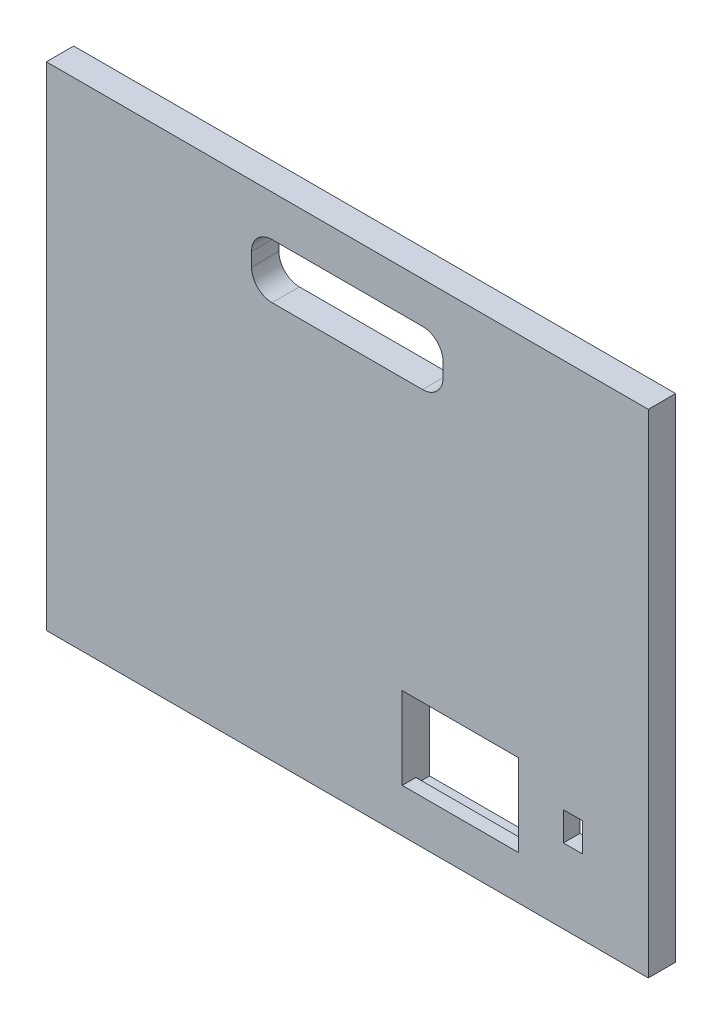
ISO-10303-21;
HEADER;
FILE_DESCRIPTION(('STEP AP214'),'2;1');
FILE_NAME('part.step','',(''),(''),'','','');
FILE_SCHEMA(('AUTOMOTIVE_DESIGN { 1 0 10303 214 1 1 1 1 }'));
ENDSEC;
DATA;
#1=APPLICATION_CONTEXT('core data for automotive mechanical design processes');
#2=APPLICATION_PROTOCOL_DEFINITION('international standard','automotive_design',2000,#1);
#3=PRODUCT_CONTEXT('',#1,'mechanical');
#4=PRODUCT('Part','Part','',(#3));
#5=PRODUCT_RELATED_PRODUCT_CATEGORY('part','',(#4));
#6=PRODUCT_DEFINITION_FORMATION('','',#4);
#7=PRODUCT_DEFINITION_CONTEXT('part definition',#1,'design');
#8=PRODUCT_DEFINITION('design','',#6,#7);
#9=PRODUCT_DEFINITION_SHAPE('','',#8);
#10=(LENGTH_UNIT() NAMED_UNIT(*) SI_UNIT(.MILLI.,.METRE.));
#11=(NAMED_UNIT(*) PLANE_ANGLE_UNIT() SI_UNIT($,.RADIAN.));
#12=(NAMED_UNIT(*) SI_UNIT($,.STERADIAN.) SOLID_ANGLE_UNIT());
#13=UNCERTAINTY_MEASURE_WITH_UNIT(LENGTH_MEASURE(1.E-05),#10,'distance_accuracy_value','');
#14=(GEOMETRIC_REPRESENTATION_CONTEXT(3) GLOBAL_UNCERTAINTY_ASSIGNED_CONTEXT((#13)) GLOBAL_UNIT_ASSIGNED_CONTEXT((#10,
#11,#12)) REPRESENTATION_CONTEXT('',''));
#15=CARTESIAN_POINT('',(0.,0.,0.));
#16=DIRECTION('',(0.,0.,1.));
#17=DIRECTION('',(1.,0.,0.));
#18=AXIS2_PLACEMENT_3D('',#15,#16,#17);
#19=CARTESIAN_POINT('',(52.4722730324973,-93.9800000000001,12.701));
#20=DIRECTION('',(0.,-1.,0.));
#21=DIRECTION('',(1.,0.,0.));
#22=AXIS2_PLACEMENT_3D('',#19,#20,#21);
#23=PLANE('',#22);
#24=DIRECTION('',(1.,0.,0.));
#25=VECTOR('',#24,1.);
#26=CARTESIAN_POINT('',(79.4597730324973,-93.9800000000001,6.35));
#27=LINE('',#26,#25);
#28=CARTESIAN_POINT('',(25.4847730324972,-93.9800000000001,6.35));
#29=VERTEX_POINT('',#28);
#30=CARTESIAN_POINT('',(79.4597730324973,-93.9800000000001,6.35));
#31=VERTEX_POINT('',#30);
#32=EDGE_CURVE('E232',#29,#31,#27,.T.);
#33=ORIENTED_EDGE('',*,*,#32,.F.);
#34=DIRECTION('',(0.,0.,-1.));
#35=VECTOR('',#34,1.);
#36=CARTESIAN_POINT('',(25.4847730324973,-93.9800000000001,12.701));
#37=LINE('',#36,#35);
#38=CARTESIAN_POINT('',(25.4847730324973,-93.9800000000001,12.7));
#39=VERTEX_POINT('',#38);
#40=EDGE_CURVE('E278',#39,#29,#37,.T.);
#41=ORIENTED_EDGE('',*,*,#40,.F.);
#42=DIRECTION('',(-1.,0.,0.));
#43=VECTOR('',#42,1.);
#44=CARTESIAN_POINT('',(52.4722730324973,-93.9800000000001,12.7));
#45=LINE('',#44,#43);
#46=CARTESIAN_POINT('',(79.4597730324973,-93.9800000000001,12.7));
#47=VERTEX_POINT('',#46);
#48=EDGE_CURVE('E272',#47,#39,#45,.T.);
#49=ORIENTED_EDGE('',*,*,#48,.F.);
#50=DIRECTION('',(0.,0.,-1.));
#51=VECTOR('',#50,1.);
#52=CARTESIAN_POINT('',(79.4597730324973,-93.9800000000001,12.701));
#53=LINE('',#52,#51);
#54=EDGE_CURVE('E285',#47,#31,#53,.T.);
#55=ORIENTED_EDGE('',*,*,#54,.T.);
#56=EDGE_LOOP('',(#33,#41,#49,#55));
#57=FACE_BOUND('',#56,.T.);
#58=ADVANCED_FACE('F32',(#57),#23,.F.);
#59=CARTESIAN_POINT('',(-139.7,114.3,12.7));
#60=DIRECTION('',(0.,0.,1.));
#61=DIRECTION('',(1.,0.,0.));
#62=AXIS2_PLACEMENT_3D('',#59,#60,#61);
#63=PLANE('',#62);
#64=ORIENTED_EDGE('',*,*,#48,.T.);
#65=DIRECTION('',(0.,-1.,0.));
#66=VECTOR('',#65,1.);
#67=CARTESIAN_POINT('',(25.4847730324973,-128.829903448404,12.7));
#68=LINE('',#67,#66);
#69=CARTESIAN_POINT('',(25.4847730324973,-55.8800000000001,12.7));
#70=VERTEX_POINT('',#69);
#71=EDGE_CURVE('E287',#70,#39,#68,.T.);
#72=ORIENTED_EDGE('',*,*,#71,.F.);
#73=DIRECTION('',(-1.,0.,0.));
#74=VECTOR('',#73,1.);
#75=CARTESIAN_POINT('',(52.4722730324973,-55.8800000000001,12.7));
#76=LINE('',#75,#74);
#77=CARTESIAN_POINT('',(79.4597730324973,-55.8800000000001,12.7));
#78=VERTEX_POINT('',#77);
#79=EDGE_CURVE('E56',#78,#70,#76,.T.);
#80=ORIENTED_EDGE('',*,*,#79,.F.);
#81=DIRECTION('',(0.,-1.,0.));
#82=VECTOR('',#81,1.);
#83=CARTESIAN_POINT('',(79.4597730324973,-128.829903448404,12.7));
#84=LINE('',#83,#82);
#85=EDGE_CURVE('E269',#78,#47,#84,.T.);
#86=ORIENTED_EDGE('',*,*,#85,.T.);
#87=EDGE_LOOP('',(#64,#72,#80,#86));
#88=FACE_BOUND('',#87,.T.);
#89=DIRECTION('',(1.,0.,0.));
#90=VECTOR('',#89,1.);
#91=CARTESIAN_POINT('',(-34.925,69.85,12.7));
#92=LINE('',#91,#90);
#93=CARTESIAN_POINT('',(-34.925,69.85,12.7));
#94=VERTEX_POINT('',#93);
#95=CARTESIAN_POINT('',(34.925,69.85,12.7));
#96=VERTEX_POINT('',#95);
#97=EDGE_CURVE('E325',#94,#96,#92,.T.);
#98=ORIENTED_EDGE('',*,*,#97,.F.);
#99=CARTESIAN_POINT('',(-34.925,79.375,12.7));
#100=DIRECTION('',(0.,0.,1.));
#101=DIRECTION('',(1.,0.,0.));
#102=AXIS2_PLACEMENT_3D('',#99,#100,#101);
#103=CIRCLE('',#102,9.525);
#104=CARTESIAN_POINT('',(-44.45,79.375,12.7));
#105=VERTEX_POINT('',#104);
#106=EDGE_CURVE('E323',#105,#94,#103,.T.);
#107=ORIENTED_EDGE('',*,*,#106,.F.);
#108=DIRECTION('',(0.,-1.,0.));
#109=VECTOR('',#108,1.);
#110=CARTESIAN_POINT('',(-44.45,85.725,12.7));
#111=LINE('',#110,#109);
#112=CARTESIAN_POINT('',(-44.45,85.725,12.7));
#113=VERTEX_POINT('',#112);
#114=EDGE_CURVE('E342',#113,#105,#111,.T.);
#115=ORIENTED_EDGE('',*,*,#114,.F.);
#116=CARTESIAN_POINT('',(-34.925,85.725,12.7));
#117=DIRECTION('',(0.,0.,1.));
#118=DIRECTION('',(1.,0.,0.));
#119=AXIS2_PLACEMENT_3D('',#116,#117,#118);
#120=CIRCLE('',#119,9.525);
#121=CARTESIAN_POINT('',(-34.925,95.25,12.7));
#122=VERTEX_POINT('',#121);
#123=EDGE_CURVE('E339',#122,#113,#120,.T.);
#124=ORIENTED_EDGE('',*,*,#123,.F.);
#125=DIRECTION('',(1.,0.,0.));
#126=VECTOR('',#125,1.);
#127=CARTESIAN_POINT('',(-34.925,95.25,12.7));
#128=LINE('',#127,#126);
#129=CARTESIAN_POINT('',(34.925,95.25,12.7));
#130=VERTEX_POINT('',#129);
#131=EDGE_CURVE('E336',#122,#130,#128,.T.);
#132=ORIENTED_EDGE('',*,*,#131,.T.);
#133=CARTESIAN_POINT('',(34.925,85.725,12.7));
#134=DIRECTION('',(0.,0.,-1.));
#135=DIRECTION('',(-1.,0.,0.));
#136=AXIS2_PLACEMENT_3D('',#133,#134,#135);
#137=CIRCLE('',#136,9.52500000000001);
#138=CARTESIAN_POINT('',(44.45,85.725,12.7));
#139=VERTEX_POINT('',#138);
#140=EDGE_CURVE('E333',#130,#139,#137,.T.);
#141=ORIENTED_EDGE('',*,*,#140,.T.);
#142=DIRECTION('',(0.,-1.,0.));
#143=VECTOR('',#142,1.);
#144=CARTESIAN_POINT('',(44.45,85.725,12.7));
#145=LINE('',#144,#143);
#146=CARTESIAN_POINT('',(44.45,79.375,12.7));
#147=VERTEX_POINT('',#146);
#148=EDGE_CURVE('E330',#139,#147,#145,.T.);
#149=ORIENTED_EDGE('',*,*,#148,.T.);
#150=CARTESIAN_POINT('',(34.925,79.375,12.7));
#151=DIRECTION('',(0.,0.,1.));
#152=DIRECTION('',(1.,0.,0.));
#153=AXIS2_PLACEMENT_3D('',#150,#151,#152);
#154=CIRCLE('',#153,9.525);
#155=EDGE_CURVE('E328',#96,#147,#154,.T.);
#156=ORIENTED_EDGE('',*,*,#155,.F.);
#157=EDGE_LOOP('',(#98,#107,#115,#124,#132,#141,#149,#156));
#158=FACE_BOUND('',#157,.T.);
#159=DIRECTION('',(0.,-1.,0.));
#160=VECTOR('',#159,1.);
#161=CARTESIAN_POINT('',(-139.7,-114.3,12.7));
#162=LINE('',#161,#160);
#163=CARTESIAN_POINT('',(-139.7,114.3,12.7));
#164=VERTEX_POINT('',#163);
#165=CARTESIAN_POINT('',(-139.7,-114.3,12.7));
#166=VERTEX_POINT('',#165);
#167=EDGE_CURVE('E385',#164,#166,#162,.T.);
#168=ORIENTED_EDGE('',*,*,#167,.T.);
#169=DIRECTION('',(1.,0.,0.));
#170=VECTOR('',#169,1.);
#171=CARTESIAN_POINT('',(139.7,-114.3,12.7));
#172=LINE('',#171,#170);
#173=CARTESIAN_POINT('',(139.7,-114.3,12.7));
#174=VERTEX_POINT('',#173);
#175=EDGE_CURVE('E388',#166,#174,#172,.T.);
#176=ORIENTED_EDGE('',*,*,#175,.T.);
#177=DIRECTION('',(0.,1.,0.));
#178=VECTOR('',#177,1.);
#179=CARTESIAN_POINT('',(139.7,-114.3,12.7));
#180=LINE('',#179,#178);
#181=CARTESIAN_POINT('',(139.7,114.3,12.7));
#182=VERTEX_POINT('',#181);
#183=EDGE_CURVE('E391',#174,#182,#180,.T.);
#184=ORIENTED_EDGE('',*,*,#183,.T.);
#185=DIRECTION('',(-1.,0.,0.));
#186=VECTOR('',#185,1.);
#187=CARTESIAN_POINT('',(139.7,114.3,12.7));
#188=LINE('',#187,#186);
#189=EDGE_CURVE('E393',#182,#164,#188,.T.);
#190=ORIENTED_EDGE('',*,*,#189,.T.);
#191=EDGE_LOOP('',(#168,#176,#184,#190));
#192=FACE_BOUND('',#191,.T.);
#193=DIRECTION('',(1.,0.,0.));
#194=VECTOR('',#193,1.);
#195=CARTESIAN_POINT('',(109.22,-79.6925000000001,12.7));
#196=LINE('',#195,#194);
#197=CARTESIAN_POINT('',(100.33,-79.6925000000001,12.7));
#198=VERTEX_POINT('',#197);
#199=CARTESIAN_POINT('',(109.22,-79.6925000000001,12.7));
#200=VERTEX_POINT('',#199);
#201=EDGE_CURVE('E292',#198,#200,#196,.T.);
#202=ORIENTED_EDGE('',*,*,#201,.F.);
#203=DIRECTION('',(0.,-1.,0.));
#204=VECTOR('',#203,1.);
#205=CARTESIAN_POINT('',(100.33,-79.6925000000001,12.7));
#206=LINE('',#205,#204);
#207=CARTESIAN_POINT('',(100.33,-66.3575000000001,12.7));
#208=VERTEX_POINT('',#207);
#209=EDGE_CURVE('E290',#208,#198,#206,.T.);
#210=ORIENTED_EDGE('',*,*,#209,.F.);
#211=DIRECTION('',(-1.,0.,0.));
#212=VECTOR('',#211,1.);
#213=CARTESIAN_POINT('',(109.22,-66.3575000000001,12.7));
#214=LINE('',#213,#212);
#215=CARTESIAN_POINT('',(109.22,-66.3575000000001,12.7));
#216=VERTEX_POINT('',#215);
#217=EDGE_CURVE('E297',#216,#208,#214,.T.);
#218=ORIENTED_EDGE('',*,*,#217,.F.);
#219=DIRECTION('',(0.,1.,0.));
#220=VECTOR('',#219,1.);
#221=CARTESIAN_POINT('',(109.22,-79.6925000000001,12.7));
#222=LINE('',#221,#220);
#223=EDGE_CURVE('E294',#200,#216,#222,.T.);
#224=ORIENTED_EDGE('',*,*,#223,.F.);
#225=EDGE_LOOP('',(#202,#210,#218,#224));
#226=FACE_BOUND('',#225,.T.);
#227=ADVANCED_FACE('F453',(#88,#158,#192,#226),#63,.T.);
#228=CARTESIAN_POINT('',(114.3,-88.9000000000001,5.08));
#229=DIRECTION('',(0.,0.,-1.));
#230=DIRECTION('',(-1.,0.,0.));
#231=AXIS2_PLACEMENT_3D('',#228,#229,#230);
#232=PLANE('',#231);
#233=DIRECTION('',(0.,1.,0.));
#234=VECTOR('',#233,1.);
#235=CARTESIAN_POINT('',(114.3,-57.1500000000001,5.08));
#236=LINE('',#235,#234);
#237=CARTESIAN_POINT('',(114.3,-88.9000000000001,5.08));
#238=VERTEX_POINT('',#237);
#239=CARTESIAN_POINT('',(114.3,-57.1500000000001,5.08));
#240=VERTEX_POINT('',#239);
#241=EDGE_CURVE('E310',#238,#240,#236,.T.);
#242=ORIENTED_EDGE('',*,*,#241,.F.);
#243=DIRECTION('',(1.,0.,0.));
#244=VECTOR('',#243,1.);
#245=CARTESIAN_POINT('',(114.3,-88.9000000000001,5.08));
#246=LINE('',#245,#244);
#247=CARTESIAN_POINT('',(95.25,-88.9000000000001,5.08));
#248=VERTEX_POINT('',#247);
#249=EDGE_CURVE('E319',#248,#238,#246,.T.);
#250=ORIENTED_EDGE('',*,*,#249,.F.);
#251=DIRECTION('',(0.,-1.,0.));
#252=VECTOR('',#251,1.);
#253=CARTESIAN_POINT('',(95.25,-57.1500000000001,5.08));
#254=LINE('',#253,#252);
#255=CARTESIAN_POINT('',(95.25,-57.1500000000001,5.08));
#256=VERTEX_POINT('',#255);
#257=EDGE_CURVE('E316',#256,#248,#254,.T.);
#258=ORIENTED_EDGE('',*,*,#257,.F.);
#259=DIRECTION('',(-1.,0.,0.));
#260=VECTOR('',#259,1.);
#261=CARTESIAN_POINT('',(114.3,-57.1500000000001,5.08));
#262=LINE('',#261,#260);
#263=EDGE_CURVE('E313',#240,#256,#262,.T.);
#264=ORIENTED_EDGE('',*,*,#263,.F.);
#265=EDGE_LOOP('',(#242,#250,#258,#264));
#266=FACE_BOUND('',#265,.T.);
#267=DIRECTION('',(-1.,0.,0.));
#268=VECTOR('',#267,1.);
#269=CARTESIAN_POINT('',(114.3,-66.3575000000001,5.08));
#270=LINE('',#269,#268);
#271=CARTESIAN_POINT('',(109.22,-66.3575000000001,5.08));
#272=VERTEX_POINT('',#271);
#273=CARTESIAN_POINT('',(100.33,-66.3575000000001,5.08));
#274=VERTEX_POINT('',#273);
#275=EDGE_CURVE('E549',#272,#274,#270,.T.);
#276=ORIENTED_EDGE('',*,*,#275,.T.);
#277=DIRECTION('',(0.,-1.,0.));
#278=VECTOR('',#277,1.);
#279=CARTESIAN_POINT('',(100.33,-88.9000000000001,5.08));
#280=LINE('',#279,#278);
#281=CARTESIAN_POINT('',(100.33,-79.6925000000001,5.08));
#282=VERTEX_POINT('',#281);
#283=EDGE_CURVE('E11',#274,#282,#280,.T.);
#284=ORIENTED_EDGE('',*,*,#283,.T.);
#285=DIRECTION('',(1.,0.,0.));
#286=VECTOR('',#285,1.);
#287=CARTESIAN_POINT('',(114.3,-79.6925000000001,5.08));
#288=LINE('',#287,#286);
#289=CARTESIAN_POINT('',(109.22,-79.6925000000001,5.08));
#290=VERTEX_POINT('',#289);
#291=EDGE_CURVE('E41',#282,#290,#288,.T.);
#292=ORIENTED_EDGE('',*,*,#291,.T.);
#293=DIRECTION('',(0.,1.,0.));
#294=VECTOR('',#293,1.);
#295=CARTESIAN_POINT('',(109.22,-88.9000000000001,5.08));
#296=LINE('',#295,#294);
#297=EDGE_CURVE('E552',#290,#272,#296,.T.);
#298=ORIENTED_EDGE('',*,*,#297,.T.);
#299=EDGE_LOOP('',(#276,#284,#292,#298));
#300=FACE_BOUND('',#299,.T.);
#301=ADVANCED_FACE('F459',(#266,#300),#232,.T.);
#302=CARTESIAN_POINT('',(-139.7,114.3,0.));
#303=DIRECTION('',(0.,0.,1.));
#304=DIRECTION('',(1.,0.,0.));
#305=AXIS2_PLACEMENT_3D('',#302,#303,#304);
#306=PLANE('',#305);
#307=DIRECTION('',(-1.,0.,0.));
#308=VECTOR('',#307,1.);
#309=CARTESIAN_POINT('',(79.4597730324973,-96.5200000000001,0.));
#310=LINE('',#309,#308);
#311=CARTESIAN_POINT('',(79.4597730324973,-96.5200000000001,0.));
#312=VERTEX_POINT('',#311);
#313=CARTESIAN_POINT('',(25.4847730324972,-96.5200000000001,0.));
#314=VERTEX_POINT('',#313);
#315=EDGE_CURVE('E245',#312,#314,#310,.T.);
#316=ORIENTED_EDGE('',*,*,#315,.F.);
#317=DIRECTION('',(0.,-1.,0.));
#318=VECTOR('',#317,1.);
#319=CARTESIAN_POINT('',(79.4597730324973,-128.829903448404,0.));
#320=LINE('',#319,#318);
#321=CARTESIAN_POINT('',(79.4597730324973,-49.5300000000001,0.));
#322=VERTEX_POINT('',#321);
#323=EDGE_CURVE('E227',#322,#312,#320,.T.);
#324=ORIENTED_EDGE('',*,*,#323,.F.);
#325=DIRECTION('',(1.,0.,0.));
#326=VECTOR('',#325,1.);
#327=CARTESIAN_POINT('',(79.4597730324973,-49.5300000000001,0.));
#328=LINE('',#327,#326);
#329=CARTESIAN_POINT('',(25.4847730324973,-49.5300000000001,0.));
#330=VERTEX_POINT('',#329);
#331=EDGE_CURVE('E251',#330,#322,#328,.T.);
#332=ORIENTED_EDGE('',*,*,#331,.F.);
#333=DIRECTION('',(0.,-1.,0.));
#334=VECTOR('',#333,1.);
#335=CARTESIAN_POINT('',(25.4847730324973,-128.829903448404,0.));
#336=LINE('',#335,#334);
#337=EDGE_CURVE('E276',#330,#314,#336,.T.);
#338=ORIENTED_EDGE('',*,*,#337,.T.);
#339=EDGE_LOOP('',(#316,#324,#332,#338));
#340=FACE_BOUND('',#339,.T.);
#341=CARTESIAN_POINT('',(-34.925,79.375,0.));
#342=DIRECTION('',(0.,0.,1.));
#343=DIRECTION('',(1.,0.,0.));
#344=AXIS2_PLACEMENT_3D('',#341,#342,#343);
#345=CIRCLE('',#344,9.525);
#346=CARTESIAN_POINT('',(-44.45,79.375,0.));
#347=VERTEX_POINT('',#346);
#348=CARTESIAN_POINT('',(-34.925,69.85,0.));
#349=VERTEX_POINT('',#348);
#350=EDGE_CURVE('E322',#347,#349,#345,.T.);
#351=ORIENTED_EDGE('',*,*,#350,.T.);
#352=DIRECTION('',(1.,0.,0.));
#353=VECTOR('',#352,1.);
#354=CARTESIAN_POINT('',(-34.925,69.85,0.));
#355=LINE('',#354,#353);
#356=CARTESIAN_POINT('',(34.925,69.85,0.));
#357=VERTEX_POINT('',#356);
#358=EDGE_CURVE('E347',#349,#357,#355,.T.);
#359=ORIENTED_EDGE('',*,*,#358,.T.);
#360=CARTESIAN_POINT('',(34.925,79.375,0.));
#361=DIRECTION('',(0.,0.,1.));
#362=DIRECTION('',(1.,0.,0.));
#363=AXIS2_PLACEMENT_3D('',#360,#361,#362);
#364=CIRCLE('',#363,9.525);
#365=CARTESIAN_POINT('',(44.45,79.375,0.));
#366=VERTEX_POINT('',#365);
#367=EDGE_CURVE('E350',#357,#366,#364,.T.);
#368=ORIENTED_EDGE('',*,*,#367,.T.);
#369=DIRECTION('',(0.,-1.,0.));
#370=VECTOR('',#369,1.);
#371=CARTESIAN_POINT('',(44.45,85.725,0.));
#372=LINE('',#371,#370);
#373=CARTESIAN_POINT('',(44.45,85.725,0.));
#374=VERTEX_POINT('',#373);
#375=EDGE_CURVE('E353',#374,#366,#372,.T.);
#376=ORIENTED_EDGE('',*,*,#375,.F.);
#377=CARTESIAN_POINT('',(34.925,85.725,0.));
#378=DIRECTION('',(0.,0.,-1.));
#379=DIRECTION('',(-1.,0.,0.));
#380=AXIS2_PLACEMENT_3D('',#377,#378,#379);
#381=CIRCLE('',#380,9.52500000000001);
#382=CARTESIAN_POINT('',(34.925,95.25,0.));
#383=VERTEX_POINT('',#382);
#384=EDGE_CURVE('E356',#383,#374,#381,.T.);
#385=ORIENTED_EDGE('',*,*,#384,.F.);
#386=DIRECTION('',(1.,0.,0.));
#387=VECTOR('',#386,1.);
#388=CARTESIAN_POINT('',(-34.925,95.25,0.));
#389=LINE('',#388,#387);
#390=CARTESIAN_POINT('',(-34.925,95.25,0.));
#391=VERTEX_POINT('',#390);
#392=EDGE_CURVE('E359',#391,#383,#389,.T.);
#393=ORIENTED_EDGE('',*,*,#392,.F.);
#394=CARTESIAN_POINT('',(-34.925,85.725,0.));
#395=DIRECTION('',(0.,0.,1.));
#396=DIRECTION('',(1.,0.,0.));
#397=AXIS2_PLACEMENT_3D('',#394,#395,#396);
#398=CIRCLE('',#397,9.525);
#399=CARTESIAN_POINT('',(-44.45,85.725,0.));
#400=VERTEX_POINT('',#399);
#401=EDGE_CURVE('E362',#391,#400,#398,.T.);
#402=ORIENTED_EDGE('',*,*,#401,.T.);
#403=DIRECTION('',(0.,-1.,0.));
#404=VECTOR('',#403,1.);
#405=CARTESIAN_POINT('',(-44.45,85.725,0.));
#406=LINE('',#405,#404);
#407=EDGE_CURVE('E326',#400,#347,#406,.T.);
#408=ORIENTED_EDGE('',*,*,#407,.T.);
#409=EDGE_LOOP('',(#351,#359,#368,#376,#385,#393,#402,#408));
#410=FACE_BOUND('',#409,.T.);
#411=DIRECTION('',(0.,-1.,0.));
#412=VECTOR('',#411,1.);
#413=CARTESIAN_POINT('',(-139.7,-114.3,0.));
#414=LINE('',#413,#412);
#415=CARTESIAN_POINT('',(-139.7,114.3,0.));
#416=VERTEX_POINT('',#415);
#417=CARTESIAN_POINT('',(-139.7,-114.3,0.));
#418=VERTEX_POINT('',#417);
#419=EDGE_CURVE('E384',#416,#418,#414,.T.);
#420=ORIENTED_EDGE('',*,*,#419,.F.);
#421=DIRECTION('',(-1.,0.,0.));
#422=VECTOR('',#421,1.);
#423=CARTESIAN_POINT('',(139.7,114.3,0.));
#424=LINE('',#423,#422);
#425=CARTESIAN_POINT('',(139.7,114.3,0.));
#426=VERTEX_POINT('',#425);
#427=EDGE_CURVE('E389',#426,#416,#424,.T.);
#428=ORIENTED_EDGE('',*,*,#427,.F.);
#429=DIRECTION('',(0.,1.,0.));
#430=VECTOR('',#429,1.);
#431=CARTESIAN_POINT('',(139.7,-114.3,0.));
#432=LINE('',#431,#430);
#433=CARTESIAN_POINT('',(139.7,-114.3,0.));
#434=VERTEX_POINT('',#433);
#435=EDGE_CURVE('E400',#434,#426,#432,.T.);
#436=ORIENTED_EDGE('',*,*,#435,.F.);
#437=DIRECTION('',(1.,0.,0.));
#438=VECTOR('',#437,1.);
#439=CARTESIAN_POINT('',(139.7,-114.3,0.));
#440=LINE('',#439,#438);
#441=EDGE_CURVE('E398',#418,#434,#440,.T.);
#442=ORIENTED_EDGE('',*,*,#441,.F.);
#443=EDGE_LOOP('',(#420,#428,#436,#442));
#444=FACE_BOUND('',#443,.T.);
#445=DIRECTION('',(0.,1.,0.));
#446=VECTOR('',#445,1.);
#447=CARTESIAN_POINT('',(86.8257730324973,114.3,0.));
#448=LINE('',#447,#446);
#449=CARTESIAN_POINT('',(86.8257730324973,-49.5300000000001,0.));
#450=VERTEX_POINT('',#449);
#451=CARTESIAN_POINT('',(86.8257730324973,-96.5200000000001,0.));
#452=VERTEX_POINT('',#451);
#453=EDGE_CURVE('E421',#450,#452,#448,.F.);
#454=ORIENTED_EDGE('',*,*,#453,.T.);
#455=DIRECTION('',(-1.,0.,0.));
#456=VECTOR('',#455,1.);
#457=CARTESIAN_POINT('',(-139.7,-96.5200000000001,0.));
#458=LINE('',#457,#456);
#459=CARTESIAN_POINT('',(122.724226967503,-96.5200000000001,0.));
#460=VERTEX_POINT('',#459);
#461=EDGE_CURVE('E414',#452,#460,#458,.F.);
#462=ORIENTED_EDGE('',*,*,#461,.T.);
#463=DIRECTION('',(0.,-1.,0.));
#464=VECTOR('',#463,1.);
#465=CARTESIAN_POINT('',(122.724226967503,114.3,0.));
#466=LINE('',#465,#464);
#467=CARTESIAN_POINT('',(122.724226967503,-49.5300000000001,0.));
#468=VERTEX_POINT('',#467);
#469=EDGE_CURVE('E418',#460,#468,#466,.F.);
#470=ORIENTED_EDGE('',*,*,#469,.T.);
#471=DIRECTION('',(1.,0.,0.));
#472=VECTOR('',#471,1.);
#473=CARTESIAN_POINT('',(-139.7,-49.5300000000001,0.));
#474=LINE('',#473,#472);
#475=EDGE_CURVE('E416',#468,#450,#474,.F.);
#476=ORIENTED_EDGE('',*,*,#475,.T.);
#477=EDGE_LOOP('',(#454,#462,#470,#476));
#478=FACE_BOUND('',#477,.T.);
#479=ADVANCED_FACE('F482',(#340,#410,#444,#478),#306,.F.);
#480=CARTESIAN_POINT('',(-139.7,-114.3,12.7));
#481=DIRECTION('',(1.,0.,0.));
#482=DIRECTION('',(0.,0.,-1.));
#483=AXIS2_PLACEMENT_3D('',#480,#481,#482);
#484=PLANE('',#483);
#485=ORIENTED_EDGE('',*,*,#419,.T.);
#486=DIRECTION('',(0.,0.,-1.));
#487=VECTOR('',#486,1.);
#488=CARTESIAN_POINT('',(-139.7,-114.3,12.7));
#489=LINE('',#488,#487);
#490=EDGE_CURVE('E411',#166,#418,#489,.T.);
#491=ORIENTED_EDGE('',*,*,#490,.F.);
#492=ORIENTED_EDGE('',*,*,#167,.F.);
#493=DIRECTION('',(0.,0.,-1.));
#494=VECTOR('',#493,1.);
#495=CARTESIAN_POINT('',(-139.7,114.3,12.7));
#496=LINE('',#495,#494);
#497=EDGE_CURVE('E395',#164,#416,#496,.T.);
#498=ORIENTED_EDGE('',*,*,#497,.T.);
#499=EDGE_LOOP('',(#485,#491,#492,#498));
#500=FACE_BOUND('',#499,.T.);
#501=ADVANCED_FACE('F519',(#500),#484,.F.);
#502=CARTESIAN_POINT('',(139.7,-114.3,12.7));
#503=DIRECTION('',(0.,1.,0.));
#504=DIRECTION('',(-1.,0.,0.));
#505=AXIS2_PLACEMENT_3D('',#502,#503,#504);
#506=PLANE('',#505);
#507=ORIENTED_EDGE('',*,*,#441,.T.);
#508=DIRECTION('',(0.,0.,-1.));
#509=VECTOR('',#508,1.);
#510=CARTESIAN_POINT('',(139.7,-114.3,12.7));
#511=LINE('',#510,#509);
#512=EDGE_CURVE('E408',#174,#434,#511,.T.);
#513=ORIENTED_EDGE('',*,*,#512,.F.);
#514=ORIENTED_EDGE('',*,*,#175,.F.);
#515=ORIENTED_EDGE('',*,*,#490,.T.);
#516=EDGE_LOOP('',(#507,#513,#514,#515));
#517=FACE_BOUND('',#516,.T.);
#518=ADVANCED_FACE('F527',(#517),#506,.F.);
#519=CARTESIAN_POINT('',(139.7,-114.3,12.7));
#520=DIRECTION('',(-1.,0.,0.));
#521=DIRECTION('',(0.,0.,1.));
#522=AXIS2_PLACEMENT_3D('',#519,#520,#521);
#523=PLANE('',#522);
#524=ORIENTED_EDGE('',*,*,#435,.T.);
#525=DIRECTION('',(0.,0.,-1.));
#526=VECTOR('',#525,1.);
#527=CARTESIAN_POINT('',(139.7,114.3,12.7));
#528=LINE('',#527,#526);
#529=EDGE_CURVE('E405',#182,#426,#528,.T.);
#530=ORIENTED_EDGE('',*,*,#529,.F.);
#531=ORIENTED_EDGE('',*,*,#183,.F.);
#532=ORIENTED_EDGE('',*,*,#512,.T.);
#533=EDGE_LOOP('',(#524,#530,#531,#532));
#534=FACE_BOUND('',#533,.T.);
#535=ADVANCED_FACE('F523',(#534),#523,.F.);
#536=CARTESIAN_POINT('',(139.7,114.3,12.7));
#537=DIRECTION('',(0.,-1.,0.));
#538=DIRECTION('',(1.,0.,0.));
#539=AXIS2_PLACEMENT_3D('',#536,#537,#538);
#540=PLANE('',#539);
#541=ORIENTED_EDGE('',*,*,#427,.T.);
#542=ORIENTED_EDGE('',*,*,#497,.F.);
#543=ORIENTED_EDGE('',*,*,#189,.F.);
#544=ORIENTED_EDGE('',*,*,#529,.T.);
#545=EDGE_LOOP('',(#541,#542,#543,#544));
#546=FACE_BOUND('',#545,.T.);
#547=ADVANCED_FACE('F514',(#546),#540,.F.);
#548=CARTESIAN_POINT('',(-34.925,79.375,12.7));
#549=DIRECTION('',(0.,0.,-1.));
#550=DIRECTION('',(-1.,0.,0.));
#551=AXIS2_PLACEMENT_3D('',#548,#549,#550);
#552=CYLINDRICAL_SURFACE('',#551,9.525);
#553=ORIENTED_EDGE('',*,*,#350,.F.);
#554=DIRECTION('',(0.,0.,-1.));
#555=VECTOR('',#554,1.);
#556=CARTESIAN_POINT('',(-44.45,79.375,12.7));
#557=LINE('',#556,#555);
#558=EDGE_CURVE('E344',#105,#347,#557,.T.);
#559=ORIENTED_EDGE('',*,*,#558,.F.);
#560=ORIENTED_EDGE('',*,*,#106,.T.);
#561=DIRECTION('',(0.,0.,-1.));
#562=VECTOR('',#561,1.);
#563=CARTESIAN_POINT('',(-34.925,69.85,12.7));
#564=LINE('',#563,#562);
#565=EDGE_CURVE('E381',#94,#349,#564,.T.);
#566=ORIENTED_EDGE('',*,*,#565,.T.);
#567=EDGE_LOOP('',(#553,#559,#560,#566));
#568=FACE_BOUND('',#567,.T.);
#569=ADVANCED_FACE('F511',(#568),#552,.F.);
#570=CARTESIAN_POINT('',(-34.925,69.85,12.7));
#571=DIRECTION('',(0.,1.,0.));
#572=DIRECTION('',(0.,0.,1.));
#573=AXIS2_PLACEMENT_3D('',#570,#571,#572);
#574=PLANE('',#573);
#575=ORIENTED_EDGE('',*,*,#358,.F.);
#576=ORIENTED_EDGE('',*,*,#565,.F.);
#577=ORIENTED_EDGE('',*,*,#97,.T.);
#578=DIRECTION('',(0.,0.,-1.));
#579=VECTOR('',#578,1.);
#580=CARTESIAN_POINT('',(34.925,69.85,12.7));
#581=LINE('',#580,#579);
#582=EDGE_CURVE('E379',#96,#357,#581,.T.);
#583=ORIENTED_EDGE('',*,*,#582,.T.);
#584=EDGE_LOOP('',(#575,#576,#577,#583));
#585=FACE_BOUND('',#584,.T.);
#586=ADVANCED_FACE('F507',(#585),#574,.T.);
#587=CARTESIAN_POINT('',(34.925,79.375,12.7));
#588=DIRECTION('',(0.,0.,-1.));
#589=DIRECTION('',(-1.,0.,0.));
#590=AXIS2_PLACEMENT_3D('',#587,#588,#589);
#591=CYLINDRICAL_SURFACE('',#590,9.525);
#592=ORIENTED_EDGE('',*,*,#367,.F.);
#593=ORIENTED_EDGE('',*,*,#582,.F.);
#594=ORIENTED_EDGE('',*,*,#155,.T.);
#595=DIRECTION('',(0.,0.,-1.));
#596=VECTOR('',#595,1.);
#597=CARTESIAN_POINT('',(44.45,79.375,12.7));
#598=LINE('',#597,#596);
#599=EDGE_CURVE('E377',#147,#366,#598,.T.);
#600=ORIENTED_EDGE('',*,*,#599,.T.);
#601=EDGE_LOOP('',(#592,#593,#594,#600));
#602=FACE_BOUND('',#601,.T.);
#603=ADVANCED_FACE('F503',(#602),#591,.F.);
#604=CARTESIAN_POINT('',(44.45,85.725,12.7));
#605=DIRECTION('',(1.,0.,0.));
#606=DIRECTION('',(0.,0.,-1.));
#607=AXIS2_PLACEMENT_3D('',#604,#605,#606);
#608=PLANE('',#607);
#609=ORIENTED_EDGE('',*,*,#375,.T.);
#610=ORIENTED_EDGE('',*,*,#599,.F.);
#611=ORIENTED_EDGE('',*,*,#148,.F.);
#612=DIRECTION('',(0.,0.,-1.));
#613=VECTOR('',#612,1.);
#614=CARTESIAN_POINT('',(44.45,85.725,12.7));
#615=LINE('',#614,#613);
#616=EDGE_CURVE('E375',#139,#374,#615,.T.);
#617=ORIENTED_EDGE('',*,*,#616,.T.);
#618=EDGE_LOOP('',(#609,#610,#611,#617));
#619=FACE_BOUND('',#618,.T.);
#620=ADVANCED_FACE('F499',(#619),#608,.F.);
#621=CARTESIAN_POINT('',(34.925,85.725,12.7));
#622=DIRECTION('',(0.,0.,-1.));
#623=DIRECTION('',(-1.,0.,0.));
#624=AXIS2_PLACEMENT_3D('',#621,#622,#623);
#625=CYLINDRICAL_SURFACE('',#624,9.52500000000001);
#626=ORIENTED_EDGE('',*,*,#384,.T.);
#627=ORIENTED_EDGE('',*,*,#616,.F.);
#628=ORIENTED_EDGE('',*,*,#140,.F.);
#629=DIRECTION('',(0.,0.,-1.));
#630=VECTOR('',#629,1.);
#631=CARTESIAN_POINT('',(34.925,95.25,12.7));
#632=LINE('',#631,#630);
#633=EDGE_CURVE('E373',#130,#383,#632,.T.);
#634=ORIENTED_EDGE('',*,*,#633,.T.);
#635=EDGE_LOOP('',(#626,#627,#628,#634));
#636=FACE_BOUND('',#635,.T.);
#637=ADVANCED_FACE('F495',(#636),#625,.F.);
#638=CARTESIAN_POINT('',(-34.925,95.25,12.7));
#639=DIRECTION('',(0.,1.,0.));
#640=DIRECTION('',(-1.,0.,0.));
#641=AXIS2_PLACEMENT_3D('',#638,#639,#640);
#642=PLANE('',#641);
#643=ORIENTED_EDGE('',*,*,#392,.T.);
#644=ORIENTED_EDGE('',*,*,#633,.F.);
#645=ORIENTED_EDGE('',*,*,#131,.F.);
#646=DIRECTION('',(0.,0.,-1.));
#647=VECTOR('',#646,1.);
#648=CARTESIAN_POINT('',(-34.925,95.25,12.7));
#649=LINE('',#648,#647);
#650=EDGE_CURVE('E371',#122,#391,#649,.T.);
#651=ORIENTED_EDGE('',*,*,#650,.T.);
#652=EDGE_LOOP('',(#643,#644,#645,#651));
#653=FACE_BOUND('',#652,.T.);
#654=ADVANCED_FACE('F491',(#653),#642,.F.);
#655=CARTESIAN_POINT('',(-34.925,85.725,12.7));
#656=DIRECTION('',(0.,0.,-1.));
#657=DIRECTION('',(-1.,0.,0.));
#658=AXIS2_PLACEMENT_3D('',#655,#656,#657);
#659=CYLINDRICAL_SURFACE('',#658,9.525);
#660=ORIENTED_EDGE('',*,*,#401,.F.);
#661=ORIENTED_EDGE('',*,*,#650,.F.);
#662=ORIENTED_EDGE('',*,*,#123,.T.);
#663=DIRECTION('',(0.,0.,-1.));
#664=VECTOR('',#663,1.);
#665=CARTESIAN_POINT('',(-44.45,85.725,12.7));
#666=LINE('',#665,#664);
#667=EDGE_CURVE('E369',#113,#400,#666,.T.);
#668=ORIENTED_EDGE('',*,*,#667,.T.);
#669=EDGE_LOOP('',(#660,#661,#662,#668));
#670=FACE_BOUND('',#669,.T.);
#671=ADVANCED_FACE('F487',(#670),#659,.F.);
#672=CARTESIAN_POINT('',(-44.45,85.725,12.7));
#673=DIRECTION('',(1.,0.,0.));
#674=DIRECTION('',(0.,1.,0.));
#675=AXIS2_PLACEMENT_3D('',#672,#673,#674);
#676=PLANE('',#675);
#677=ORIENTED_EDGE('',*,*,#407,.F.);
#678=ORIENTED_EDGE('',*,*,#667,.F.);
#679=ORIENTED_EDGE('',*,*,#114,.T.);
#680=ORIENTED_EDGE('',*,*,#558,.T.);
#681=EDGE_LOOP('',(#677,#678,#679,#680));
#682=FACE_BOUND('',#681,.T.);
#683=ADVANCED_FACE('F484',(#682),#676,.T.);
#684=CARTESIAN_POINT('',(114.3,-49.5300000000001,8.255));
#685=DIRECTION('',(1.,0.,0.));
#686=DIRECTION('',(0.,0.,-1.));
#687=AXIS2_PLACEMENT_3D('',#684,#685,#686);
#688=CYLINDRICAL_SURFACE('',#687,8.255);
#689=ORIENTED_EDGE('',*,*,#475,.F.);
#690=CARTESIAN_POINT('',(114.3,-57.1500000000001,5.08));
#691=CARTESIAN_POINT('',(114.423456148116,-57.052494442345,4.84600924250289));
#692=CARTESIAN_POINT('',(114.554968412604,-56.9458524049736,4.62039174984862));
#693=CARTESIAN_POINT('',(114.831577901717,-56.7170569886066,4.18667780610222));
#694=CARTESIAN_POINT('',(114.976647724072,-56.5949347271188,3.97854756145428));
#695=CARTESIAN_POINT('',(115.276878547269,-56.3387911661862,3.58160133216638));
#696=CARTESIAN_POINT('',(115.431927175388,-56.204897704958,3.39261659102822));
#697=CARTESIAN_POINT('',(115.75163899453,-55.9261780998974,3.03139920683226));
#698=CARTESIAN_POINT('',(115.916308332096,-55.781344949155,2.85917746492731));
#699=CARTESIAN_POINT('',(116.305662713843,-55.4364827846224,2.48068320072075));
#700=CARTESIAN_POINT('',(116.533194359624,-55.2332068979537,2.28029030466249));
#701=CARTESIAN_POINT('',(116.999001734272,-54.8143609830986,1.90682642613882));
#702=CARTESIAN_POINT('',(117.237279057778,-54.5987891289476,1.73375951606658));
#703=CARTESIAN_POINT('',(117.72356861773,-54.1567911036421,1.4130138549447));
#704=CARTESIAN_POINT('',(117.971625995299,-53.9303131755063,1.26547542737562));
#705=CARTESIAN_POINT('',(118.474348912576,-53.4697608562364,0.995901300712535));
#706=CARTESIAN_POINT('',(118.72901435687,-53.2356865747727,0.873865233623912));
#707=CARTESIAN_POINT('',(119.288211555168,-52.7204289240274,0.63527648683203));
#708=CARTESIAN_POINT('',(119.593711816165,-52.4381336161154,0.523370180636015));
#709=CARTESIAN_POINT('',(120.209554473842,-51.867954391764,0.332280243071326));
#710=CARTESIAN_POINT('',(120.519898207731,-51.5800689264113,0.253105820468923));
#711=CARTESIAN_POINT('',(121.453732140837,-50.7127662788266,0.0638269905503972));
#712=CARTESIAN_POINT('',(122.082468931179,-50.1274442196838,0.000951322483293083));
#713=CARTESIAN_POINT('',(122.714702636675,-49.5388666689073,3.57542297272728E-06));
#714=CARTESIAN_POINT('',(122.719464840343,-49.5344332985442,4.1680921110126E-09));
#715=CARTESIAN_POINT('',(122.724226967503,-49.5300000000001,0.));
#716=B_SPLINE_CURVE_WITH_KNOTS('',3,(#690,#691,#692,#693,#694,#695,#696,#697,#698,#699,#700,
#701,#702,#703,#704,#705,#706,#707,#708,#709,#710,#711,#712,#713,#714,#715),.UNSPECIFIED.,.F.,
.F.,(4,2,2,2,2,2,2,2,2,2,2,2,4),(0.,0.845109897462223,1.68854716832948,2.52374832648491,
3.35948904577499,4.45298124145066,5.54663624682428,6.64612396539505,7.74559581745389,
9.03631844570615,10.3274039582858,12.8992318184563,12.918751042693),.UNSPECIFIED.);
#717=EDGE_CURVE('E538',#468,#240,#716,.F.);
#718=ORIENTED_EDGE('',*,*,#717,.T.);
#719=ORIENTED_EDGE('',*,*,#263,.T.);
#720=CARTESIAN_POINT('',(95.25,-57.1500000000001,5.08));
#721=CARTESIAN_POINT('',(95.1265438518837,-57.052494442345,4.8460092425029));
#722=CARTESIAN_POINT('',(94.9950315873956,-56.9458524049736,4.62039174984862));
#723=CARTESIAN_POINT('',(94.7184220982833,-56.7170569886066,4.18667780610221));
#724=CARTESIAN_POINT('',(94.5733522759275,-56.5949347271188,3.97854756145428));
#725=CARTESIAN_POINT('',(94.2731214527305,-56.3387911661862,3.58160133216638));
#726=CARTESIAN_POINT('',(94.1180728246123,-56.204897704958,3.39261659102821));
#727=CARTESIAN_POINT('',(93.7983610054699,-55.9261780998974,3.03139920683225));
#728=CARTESIAN_POINT('',(93.6336916679036,-55.781344949155,2.85917746492731));
#729=CARTESIAN_POINT('',(93.2443372861567,-55.4364827846224,2.48068320072075));
#730=CARTESIAN_POINT('',(93.0168056403761,-55.2332068979537,2.28029030466249));
#731=CARTESIAN_POINT('',(92.5509982657281,-54.8143609830986,1.90682642613882));
#732=CARTESIAN_POINT('',(92.3127209422218,-54.5987891289476,1.73375951606658));
#733=CARTESIAN_POINT('',(91.8264313822697,-54.1567911036421,1.4130138549447));
#734=CARTESIAN_POINT('',(91.5783740047008,-53.9303131755063,1.26547542737562));
#735=CARTESIAN_POINT('',(91.0756510874243,-53.4697608562364,0.995901300712537));
#736=CARTESIAN_POINT('',(90.8209856431295,-53.2356865747727,0.873865233623913));
#737=CARTESIAN_POINT('',(90.2617884448321,-52.7204289240274,0.635276486832031));
#738=CARTESIAN_POINT('',(89.9562881838345,-52.4381336161154,0.523370180636015));
#739=CARTESIAN_POINT('',(89.3404455261578,-51.867954391764,0.332280243071326));
#740=CARTESIAN_POINT('',(89.0301017922691,-51.5800689264113,0.253105820468923));
#741=CARTESIAN_POINT('',(88.0962678591632,-50.7127662788266,0.0638269905503973));
#742=CARTESIAN_POINT('',(87.4675310688207,-50.1274442196838,0.000951322483293084));
#743=CARTESIAN_POINT('',(86.8352973633249,-49.5388666689073,3.57542297272727E-06));
#744=CARTESIAN_POINT('',(86.8305351596572,-49.5344332985442,4.16809211100616E-09));
#745=CARTESIAN_POINT('',(86.8257730324973,-49.5300000000001,0.));
#746=B_SPLINE_CURVE_WITH_KNOTS('',3,(#720,#721,#722,#723,#724,#725,#726,#727,#728,#729,#730,
#731,#732,#733,#734,#735,#736,#737,#738,#739,#740,#741,#742,#743,#744,#745),.UNSPECIFIED.,.F.,
.F.,(4,2,2,2,2,2,2,2,2,2,2,2,4),(0.,0.845109897462223,1.68854716832948,2.52374832648493,
3.35948904577499,4.45298124145066,5.54663624682428,6.64612396539503,7.74559581745389,
9.03631844570615,10.3274039582858,12.8992318184563,12.918751042693),.UNSPECIFIED.);
#747=EDGE_CURVE('E430',#256,#450,#746,.T.);
#748=ORIENTED_EDGE('',*,*,#747,.T.);
#749=EDGE_LOOP('',(#689,#718,#719,#748));
#750=FACE_BOUND('',#749,.T.);
#751=ADVANCED_FACE('F449',(#750),#688,.T.);
#752=CARTESIAN_POINT('',(114.3,-96.5200000000001,8.255));
#753=DIRECTION('',(-1.,0.,0.));
#754=DIRECTION('',(0.,0.,1.));
#755=AXIS2_PLACEMENT_3D('',#752,#753,#754);
#756=CYLINDRICAL_SURFACE('',#755,8.255);
#757=ORIENTED_EDGE('',*,*,#461,.F.);
#758=CARTESIAN_POINT('',(95.25,-88.9000000000001,5.08));
#759=CARTESIAN_POINT('',(95.1265438518837,-88.9975055576551,4.84600924250289));
#760=CARTESIAN_POINT('',(94.9950315873956,-89.1041475950265,4.62039174984861));
#761=CARTESIAN_POINT('',(94.7184220982833,-89.3329430113935,4.18667780610221));
#762=CARTESIAN_POINT('',(94.5733522759275,-89.4550652728813,3.97854756145427));
#763=CARTESIAN_POINT('',(94.2731214527305,-89.711208833814,3.58160133216636));
#764=CARTESIAN_POINT('',(94.1180728246123,-89.8451022950422,3.3926165910282));
#765=CARTESIAN_POINT('',(93.7983610054699,-90.1238219001027,3.03139920683224));
#766=CARTESIAN_POINT('',(93.6336916679036,-90.2686550508451,2.8591774649273));
#767=CARTESIAN_POINT('',(93.2443372861567,-90.6135172153777,2.48068320072075));
#768=CARTESIAN_POINT('',(93.0168056403761,-90.8167931020464,2.28029030466249));
#769=CARTESIAN_POINT('',(92.5509982657281,-91.2356390169015,1.90682642613882));
#770=CARTESIAN_POINT('',(92.3127209422218,-91.4512108710525,1.73375951606658));
#771=CARTESIAN_POINT('',(91.8264313822697,-91.893208896358,1.4130138549447));
#772=CARTESIAN_POINT('',(91.5783740047008,-92.1196868244938,1.26547542737563));
#773=CARTESIAN_POINT('',(91.0756510874243,-92.5802391437637,0.995901300712543));
#774=CARTESIAN_POINT('',(90.8209856431295,-92.8143134252275,0.873865233623918));
#775=CARTESIAN_POINT('',(90.2617884448321,-93.3295710759727,0.635276486832036));
#776=CARTESIAN_POINT('',(89.9562881838344,-93.6118663838846,0.52337018063602));
#777=CARTESIAN_POINT('',(89.3404455261579,-94.1820456082361,0.332280243071327));
#778=CARTESIAN_POINT('',(89.0301017922693,-94.4699310735891,0.253105820468921));
#779=CARTESIAN_POINT('',(88.0962678591628,-95.337233721173,0.0638269905504084));
#780=CARTESIAN_POINT('',(87.4675310688183,-95.9225557803138,0.00095132248333446));
#781=CARTESIAN_POINT('',(86.8352973633249,-96.5111333310928,3.57542297334725E-06));
#782=CARTESIAN_POINT('',(86.8305351596572,-96.5155667014559,4.1680924199622E-09));
#783=CARTESIAN_POINT('',(86.8257730324973,-96.5200000000001,0.));
#784=B_SPLINE_CURVE_WITH_KNOTS('',3,(#758,#759,#760,#761,#762,#763,#764,#765,#766,#767,#768,
#769,#770,#771,#772,#773,#774,#775,#776,#777,#778,#779,#780,#781,#782,#783),.UNSPECIFIED.,.F.,
.F.,(4,2,2,2,2,2,2,2,2,2,2,2,4),(0.,0.84510989746223,1.6885471683295,2.52374832648495,
3.359489045775,4.45298124145066,5.54663624682427,6.64612396539503,7.74559581745387,
9.03631844570612,10.3274039582858,12.8992318184563,12.918751042693),.UNSPECIFIED.);
#785=EDGE_CURVE('E424',#452,#248,#784,.F.);
#786=ORIENTED_EDGE('',*,*,#785,.T.);
#787=ORIENTED_EDGE('',*,*,#249,.T.);
#788=CARTESIAN_POINT('',(114.3,-88.9000000000001,5.08));
#789=CARTESIAN_POINT('',(114.423456148116,-88.9975055576551,4.84600924250289));
#790=CARTESIAN_POINT('',(114.554968412604,-89.1041475950265,4.62039174984861));
#791=CARTESIAN_POINT('',(114.831577901717,-89.3329430113935,4.18667780610221));
#792=CARTESIAN_POINT('',(114.976647724072,-89.4550652728813,3.97854756145427));
#793=CARTESIAN_POINT('',(115.276878547269,-89.711208833814,3.58160133216637));
#794=CARTESIAN_POINT('',(115.431927175388,-89.8451022950422,3.39261659102821));
#795=CARTESIAN_POINT('',(115.75163899453,-90.1238219001027,3.03139920683225));
#796=CARTESIAN_POINT('',(115.916308332096,-90.2686550508451,2.85917746492731));
#797=CARTESIAN_POINT('',(116.305662713843,-90.6135172153777,2.48068320072075));
#798=CARTESIAN_POINT('',(116.533194359624,-90.8167931020464,2.28029030466249));
#799=CARTESIAN_POINT('',(116.999001734272,-91.2356390169015,1.90682642613882));
#800=CARTESIAN_POINT('',(117.237279057778,-91.4512108710525,1.73375951606658));
#801=CARTESIAN_POINT('',(117.72356861773,-91.893208896358,1.4130138549447));
#802=CARTESIAN_POINT('',(117.971625995299,-92.1196868244938,1.26547542737563));
#803=CARTESIAN_POINT('',(118.474348912576,-92.5802391437637,0.995901300712543));
#804=CARTESIAN_POINT('',(118.72901435687,-92.8143134252275,0.873865233623918));
#805=CARTESIAN_POINT('',(119.288211555168,-93.3295710759727,0.635276486832036));
#806=CARTESIAN_POINT('',(119.593711816165,-93.6118663838846,0.52337018063602));
#807=CARTESIAN_POINT('',(120.209554473842,-94.1820456082361,0.332280243071327));
#808=CARTESIAN_POINT('',(120.519898207731,-94.4699310735891,0.253105820468921));
#809=CARTESIAN_POINT('',(121.453732140837,-95.337233721173,0.0638269905504084));
#810=CARTESIAN_POINT('',(122.082468931182,-95.9225557803138,0.00095132248333446));
#811=CARTESIAN_POINT('',(122.714702636675,-96.5111333310928,3.57542297334725E-06));
#812=CARTESIAN_POINT('',(122.719464840343,-96.5155667014559,4.1680924199622E-09));
#813=CARTESIAN_POINT('',(122.724226967503,-96.5200000000001,0.));
#814=B_SPLINE_CURVE_WITH_KNOTS('',3,(#788,#789,#790,#791,#792,#793,#794,#795,#796,#797,#798,
#799,#800,#801,#802,#803,#804,#805,#806,#807,#808,#809,#810,#811,#812,#813),.UNSPECIFIED.,.F.,
.F.,(4,2,2,2,2,2,2,2,2,2,2,2,4),(0.,0.84510989746223,1.6885471683295,2.52374832648492,
3.359489045775,4.45298124145066,5.54663624682427,6.64612396539503,7.74559581745387,
9.03631844570612,10.3274039582858,12.8992318184563,12.918751042693),.UNSPECIFIED.);
#815=EDGE_CURVE('E543',#238,#460,#814,.T.);
#816=ORIENTED_EDGE('',*,*,#815,.T.);
#817=EDGE_LOOP('',(#757,#786,#787,#816));
#818=FACE_BOUND('',#817,.T.);
#819=ADVANCED_FACE('F436',(#818),#756,.T.);
#820=CARTESIAN_POINT('',(86.8257730324973,-57.1500000000001,9.525));
#821=DIRECTION('',(0.,1.,0.));
#822=DIRECTION('',(0.,0.,1.));
#823=AXIS2_PLACEMENT_3D('',#820,#821,#822);
#824=CYLINDRICAL_SURFACE('',#823,9.525);
#825=ORIENTED_EDGE('',*,*,#747,.F.);
#826=ORIENTED_EDGE('',*,*,#257,.T.);
#827=ORIENTED_EDGE('',*,*,#785,.F.);
#828=ORIENTED_EDGE('',*,*,#453,.F.);
#829=EDGE_LOOP('',(#825,#826,#827,#828));
#830=FACE_BOUND('',#829,.T.);
#831=ADVANCED_FACE('F438',(#830),#824,.T.);
#832=CARTESIAN_POINT('',(122.724226967503,-57.1500000000001,9.525));
#833=DIRECTION('',(0.,-1.,0.));
#834=DIRECTION('',(0.,0.,-1.));
#835=AXIS2_PLACEMENT_3D('',#832,#833,#834);
#836=CYLINDRICAL_SURFACE('',#835,9.525);
#837=ORIENTED_EDGE('',*,*,#815,.F.);
#838=ORIENTED_EDGE('',*,*,#241,.T.);
#839=ORIENTED_EDGE('',*,*,#717,.F.);
#840=ORIENTED_EDGE('',*,*,#469,.F.);
#841=EDGE_LOOP('',(#837,#838,#839,#840));
#842=FACE_BOUND('',#841,.T.);
#843=ADVANCED_FACE('F34',(#842),#836,.T.);
#844=CARTESIAN_POINT('',(100.33,-79.6925000000001,12.7));
#845=DIRECTION('',(1.,0.,0.));
#846=DIRECTION('',(0.,0.,-1.));
#847=AXIS2_PLACEMENT_3D('',#844,#845,#846);
#848=PLANE('',#847);
#849=DIRECTION('',(0.,0.,-1.));
#850=VECTOR('',#849,1.);
#851=CARTESIAN_POINT('',(100.33,-66.3575000000001,12.7));
#852=LINE('',#851,#850);
#853=EDGE_CURVE('E299',#208,#274,#852,.T.);
#854=ORIENTED_EDGE('',*,*,#853,.F.);
#855=ORIENTED_EDGE('',*,*,#209,.T.);
#856=DIRECTION('',(0.,0.,-1.));
#857=VECTOR('',#856,1.);
#858=CARTESIAN_POINT('',(100.33,-79.6925000000001,12.7));
#859=LINE('',#858,#857);
#860=EDGE_CURVE('E307',#198,#282,#859,.T.);
#861=ORIENTED_EDGE('',*,*,#860,.T.);
#862=ORIENTED_EDGE('',*,*,#283,.F.);
#863=EDGE_LOOP('',(#854,#855,#861,#862));
#864=FACE_BOUND('',#863,.T.);
#865=ADVANCED_FACE('F447',(#864),#848,.T.);
#866=CARTESIAN_POINT('',(109.22,-79.6925000000001,12.7));
#867=DIRECTION('',(0.,1.,0.));
#868=DIRECTION('',(0.,0.,1.));
#869=AXIS2_PLACEMENT_3D('',#866,#867,#868);
#870=PLANE('',#869);
#871=ORIENTED_EDGE('',*,*,#860,.F.);
#872=ORIENTED_EDGE('',*,*,#201,.T.);
#873=DIRECTION('',(0.,0.,-1.));
#874=VECTOR('',#873,1.);
#875=CARTESIAN_POINT('',(109.22,-79.6925000000001,12.7));
#876=LINE('',#875,#874);
#877=EDGE_CURVE('E304',#200,#290,#876,.T.);
#878=ORIENTED_EDGE('',*,*,#877,.T.);
#879=ORIENTED_EDGE('',*,*,#291,.F.);
#880=EDGE_LOOP('',(#871,#872,#878,#879));
#881=FACE_BOUND('',#880,.T.);
#882=ADVANCED_FACE('F472',(#881),#870,.T.);
#883=CARTESIAN_POINT('',(109.22,-79.6925000000001,12.7));
#884=DIRECTION('',(-1.,0.,0.));
#885=DIRECTION('',(0.,0.,1.));
#886=AXIS2_PLACEMENT_3D('',#883,#884,#885);
#887=PLANE('',#886);
#888=ORIENTED_EDGE('',*,*,#877,.F.);
#889=ORIENTED_EDGE('',*,*,#223,.T.);
#890=DIRECTION('',(0.,0.,-1.));
#891=VECTOR('',#890,1.);
#892=CARTESIAN_POINT('',(109.22,-66.3575000000001,12.7));
#893=LINE('',#892,#891);
#894=EDGE_CURVE('E301',#216,#272,#893,.T.);
#895=ORIENTED_EDGE('',*,*,#894,.T.);
#896=ORIENTED_EDGE('',*,*,#297,.F.);
#897=EDGE_LOOP('',(#888,#889,#895,#896));
#898=FACE_BOUND('',#897,.T.);
#899=ADVANCED_FACE('F468',(#898),#887,.T.);
#900=CARTESIAN_POINT('',(109.22,-66.3575000000001,12.7));
#901=DIRECTION('',(0.,-1.,0.));
#902=DIRECTION('',(0.,0.,-1.));
#903=AXIS2_PLACEMENT_3D('',#900,#901,#902);
#904=PLANE('',#903);
#905=ORIENTED_EDGE('',*,*,#894,.F.);
#906=ORIENTED_EDGE('',*,*,#217,.T.);
#907=ORIENTED_EDGE('',*,*,#853,.T.);
#908=ORIENTED_EDGE('',*,*,#275,.F.);
#909=EDGE_LOOP('',(#905,#906,#907,#908));
#910=FACE_BOUND('',#909,.T.);
#911=ADVANCED_FACE('F465',(#910),#904,.T.);
#912=CARTESIAN_POINT('',(79.4597730324973,-128.829903448404,12.701));
#913=DIRECTION('',(1.,0.,0.));
#914=DIRECTION('',(0.,1.,0.));
#915=AXIS2_PLACEMENT_3D('',#912,#913,#914);
#916=PLANE('',#915);
#917=DIRECTION('',(0.,0.,-1.));
#918=VECTOR('',#917,1.);
#919=CARTESIAN_POINT('',(79.4597730324973,-55.8800000000001,12.701));
#920=LINE('',#919,#918);
#921=CARTESIAN_POINT('',(79.4597730324973,-55.8800000000001,6.35));
#922=VERTEX_POINT('',#921);
#923=EDGE_CURVE('E283',#78,#922,#920,.T.);
#924=ORIENTED_EDGE('',*,*,#923,.T.);
#925=DIRECTION('',(0.,-1.,0.));
#926=VECTOR('',#925,1.);
#927=CARTESIAN_POINT('',(79.4597730324973,-55.8800000000001,6.35));
#928=LINE('',#927,#926);
#929=CARTESIAN_POINT('',(79.4597730324973,-49.5300000000001,6.35));
#930=VERTEX_POINT('',#929);
#931=EDGE_CURVE('E253',#930,#922,#928,.T.);
#932=ORIENTED_EDGE('',*,*,#931,.F.);
#933=DIRECTION('',(0.,0.,-1.));
#934=VECTOR('',#933,1.);
#935=CARTESIAN_POINT('',(79.4597730324973,-49.5300000000001,6.35));
#936=LINE('',#935,#934);
#937=EDGE_CURVE('E264',#930,#322,#936,.T.);
#938=ORIENTED_EDGE('',*,*,#937,.T.);
#939=ORIENTED_EDGE('',*,*,#323,.T.);
#940=DIRECTION('',(0.,0.,-1.));
#941=VECTOR('',#940,1.);
#942=CARTESIAN_POINT('',(79.4597730324973,-96.5200000000001,6.35));
#943=LINE('',#942,#941);
#944=CARTESIAN_POINT('',(79.4597730324973,-96.5200000000001,6.35));
#945=VERTEX_POINT('',#944);
#946=EDGE_CURVE('E219',#945,#312,#943,.T.);
#947=ORIENTED_EDGE('',*,*,#946,.F.);
#948=DIRECTION('',(0.,-1.,0.));
#949=VECTOR('',#948,1.);
#950=CARTESIAN_POINT('',(79.4597730324973,-93.9800000000001,6.35));
#951=LINE('',#950,#949);
#952=EDGE_CURVE('E224',#31,#945,#951,.T.);
#953=ORIENTED_EDGE('',*,*,#952,.F.);
#954=ORIENTED_EDGE('',*,*,#54,.F.);
#955=ORIENTED_EDGE('',*,*,#85,.F.);
#956=EDGE_LOOP('',(#924,#932,#938,#939,#947,#953,#954,#955));
#957=FACE_BOUND('',#956,.T.);
#958=ADVANCED_FACE('F222',(#957),#916,.F.);
#959=CARTESIAN_POINT('',(52.4722730324973,-55.8800000000001,12.701));
#960=DIRECTION('',(0.,-1.,0.));
#961=DIRECTION('',(1.,0.,0.));
#962=AXIS2_PLACEMENT_3D('',#959,#960,#961);
#963=PLANE('',#962);
#964=DIRECTION('',(-1.,0.,0.));
#965=VECTOR('',#964,1.);
#966=CARTESIAN_POINT('',(79.4597730324973,-55.8800000000001,6.35));
#967=LINE('',#966,#965);
#968=CARTESIAN_POINT('',(25.4847730324973,-55.8800000000001,6.35));
#969=VERTEX_POINT('',#968);
#970=EDGE_CURVE('E48',#922,#969,#967,.T.);
#971=ORIENTED_EDGE('',*,*,#970,.F.);
#972=ORIENTED_EDGE('',*,*,#923,.F.);
#973=ORIENTED_EDGE('',*,*,#79,.T.);
#974=DIRECTION('',(0.,0.,-1.));
#975=VECTOR('',#974,1.);
#976=CARTESIAN_POINT('',(25.4847730324973,-55.8800000000001,12.701));
#977=LINE('',#976,#975);
#978=EDGE_CURVE('E281',#70,#969,#977,.T.);
#979=ORIENTED_EDGE('',*,*,#978,.T.);
#980=EDGE_LOOP('',(#971,#972,#973,#979));
#981=FACE_BOUND('',#980,.T.);
#982=ADVANCED_FACE('F651',(#981),#963,.T.);
#983=CARTESIAN_POINT('',(25.4847730324973,-128.829903448404,12.701));
#984=DIRECTION('',(1.,0.,0.));
#985=DIRECTION('',(0.,1.,0.));
#986=AXIS2_PLACEMENT_3D('',#983,#984,#985);
#987=PLANE('',#986);
#988=ORIENTED_EDGE('',*,*,#71,.T.);
#989=ORIENTED_EDGE('',*,*,#40,.T.);
#990=DIRECTION('',(0.,1.,0.));
#991=VECTOR('',#990,1.);
#992=CARTESIAN_POINT('',(25.4847730324972,-93.9800000000001,6.35));
#993=LINE('',#992,#991);
#994=CARTESIAN_POINT('',(25.4847730324972,-96.5200000000001,6.35));
#995=VERTEX_POINT('',#994);
#996=EDGE_CURVE('E240',#995,#29,#993,.T.);
#997=ORIENTED_EDGE('',*,*,#996,.F.);
#998=DIRECTION('',(0.,0.,-1.));
#999=VECTOR('',#998,1.);
#1000=CARTESIAN_POINT('',(25.4847730324972,-96.5200000000001,6.35));
#1001=LINE('',#1000,#999);
#1002=EDGE_CURVE('E231',#995,#314,#1001,.T.);
#1003=ORIENTED_EDGE('',*,*,#1002,.T.);
#1004=ORIENTED_EDGE('',*,*,#337,.F.);
#1005=DIRECTION('',(0.,0.,-1.));
#1006=VECTOR('',#1005,1.);
#1007=CARTESIAN_POINT('',(25.4847730324973,-49.5300000000001,6.35));
#1008=LINE('',#1007,#1006);
#1009=CARTESIAN_POINT('',(25.4847730324973,-49.5300000000001,6.35));
#1010=VERTEX_POINT('',#1009);
#1011=EDGE_CURVE('E261',#1010,#330,#1008,.T.);
#1012=ORIENTED_EDGE('',*,*,#1011,.F.);
#1013=DIRECTION('',(0.,1.,0.));
#1014=VECTOR('',#1013,1.);
#1015=CARTESIAN_POINT('',(25.4847730324973,-55.8800000000001,6.35));
#1016=LINE('',#1015,#1014);
#1017=EDGE_CURVE('E256',#969,#1010,#1016,.T.);
#1018=ORIENTED_EDGE('',*,*,#1017,.F.);
#1019=ORIENTED_EDGE('',*,*,#978,.F.);
#1020=EDGE_LOOP('',(#988,#989,#997,#1003,#1004,#1012,#1018,#1019));
#1021=FACE_BOUND('',#1020,.T.);
#1022=ADVANCED_FACE('F660',(#1021),#987,.T.);
#1023=CARTESIAN_POINT('',(79.4597730324973,-49.5300000000001,6.35));
#1024=DIRECTION('',(0.,1.,0.));
#1025=DIRECTION('',(0.,0.,1.));
#1026=AXIS2_PLACEMENT_3D('',#1023,#1024,#1025);
#1027=PLANE('',#1026);
#1028=ORIENTED_EDGE('',*,*,#331,.T.);
#1029=ORIENTED_EDGE('',*,*,#937,.F.);
#1030=DIRECTION('',(1.,0.,0.));
#1031=VECTOR('',#1030,1.);
#1032=CARTESIAN_POINT('',(79.4597730324973,-49.5300000000001,6.35));
#1033=LINE('',#1032,#1031);
#1034=EDGE_CURVE('E258',#1010,#930,#1033,.T.);
#1035=ORIENTED_EDGE('',*,*,#1034,.F.);
#1036=ORIENTED_EDGE('',*,*,#1011,.T.);
#1037=EDGE_LOOP('',(#1028,#1029,#1035,#1036));
#1038=FACE_BOUND('',#1037,.T.);
#1039=ADVANCED_FACE('F670',(#1038),#1027,.F.);
#1040=CARTESIAN_POINT('',(79.4597730324973,-49.5300000000001,6.35));
#1041=DIRECTION('',(0.,0.,1.));
#1042=DIRECTION('',(1.,0.,0.));
#1043=AXIS2_PLACEMENT_3D('',#1040,#1041,#1042);
#1044=PLANE('',#1043);
#1045=ORIENTED_EDGE('',*,*,#931,.T.);
#1046=ORIENTED_EDGE('',*,*,#970,.T.);
#1047=ORIENTED_EDGE('',*,*,#1017,.T.);
#1048=ORIENTED_EDGE('',*,*,#1034,.T.);
#1049=EDGE_LOOP('',(#1045,#1046,#1047,#1048));
#1050=FACE_BOUND('',#1049,.T.);
#1051=ADVANCED_FACE('F680',(#1050),#1044,.F.);
#1052=CARTESIAN_POINT('',(79.4597730324973,-96.5200000000001,6.35));
#1053=DIRECTION('',(0.,-1.,0.));
#1054=DIRECTION('',(0.,0.,-1.));
#1055=AXIS2_PLACEMENT_3D('',#1052,#1053,#1054);
#1056=PLANE('',#1055);
#1057=ORIENTED_EDGE('',*,*,#315,.T.);
#1058=ORIENTED_EDGE('',*,*,#1002,.F.);
#1059=DIRECTION('',(-1.,0.,0.));
#1060=VECTOR('',#1059,1.);
#1061=CARTESIAN_POINT('',(79.4597730324973,-96.5200000000001,6.35));
#1062=LINE('',#1061,#1060);
#1063=EDGE_CURVE('E235',#945,#995,#1062,.T.);
#1064=ORIENTED_EDGE('',*,*,#1063,.F.);
#1065=ORIENTED_EDGE('',*,*,#946,.T.);
#1066=EDGE_LOOP('',(#1057,#1058,#1064,#1065));
#1067=FACE_BOUND('',#1066,.T.);
#1068=ADVANCED_FACE('F236',(#1067),#1056,.F.);
#1069=CARTESIAN_POINT('',(79.4597730324973,-96.5200000000001,6.35));
#1070=DIRECTION('',(0.,0.,-1.));
#1071=DIRECTION('',(-1.,0.,0.));
#1072=AXIS2_PLACEMENT_3D('',#1069,#1070,#1071);
#1073=PLANE('',#1072);
#1074=ORIENTED_EDGE('',*,*,#952,.T.);
#1075=ORIENTED_EDGE('',*,*,#1063,.T.);
#1076=ORIENTED_EDGE('',*,*,#996,.T.);
#1077=ORIENTED_EDGE('',*,*,#32,.T.);
#1078=EDGE_LOOP('',(#1074,#1075,#1076,#1077));
#1079=FACE_BOUND('',#1078,.T.);
#1080=ADVANCED_FACE('F242',(#1079),#1073,.T.);
#1081=CLOSED_SHELL('',(#58,#227,#301,#479,#501,#518,#535,#547,#569,#586,#603,#620,#637,#654,
#671,#683,#751,#819,#831,#843,#865,#882,#899,#911,#958,#982,#1022,#1039,#1051,#1068,#1080));
#1082=MANIFOLD_SOLID_BREP('B2',#1081);
#1083=ADVANCED_BREP_SHAPE_REPRESENTATION('',(#18,#1082),#14);
#1084=SHAPE_DEFINITION_REPRESENTATION(#9,#1083);
ENDSEC;
END-ISO-10303-21;
